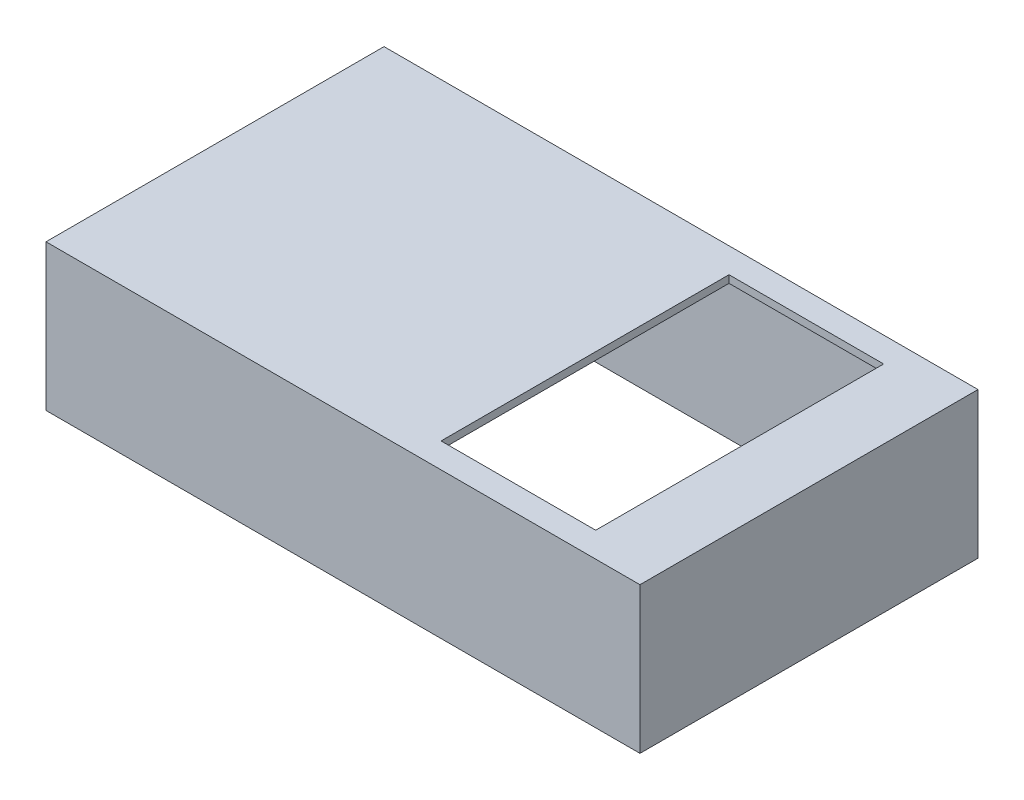
ISO-10303-21;
HEADER;
FILE_DESCRIPTION(('STEP AP214'),'2;1');
FILE_NAME('part.step','',(''),(''),'','','');
FILE_SCHEMA(('AUTOMOTIVE_DESIGN { 1 0 10303 214 1 1 1 1 }'));
ENDSEC;
DATA;
#1=APPLICATION_CONTEXT('core data for automotive mechanical design processes');
#2=APPLICATION_PROTOCOL_DEFINITION('international standard','automotive_design',2000,#1);
#3=PRODUCT_CONTEXT('',#1,'mechanical');
#4=PRODUCT('Part','Part','',(#3));
#5=PRODUCT_RELATED_PRODUCT_CATEGORY('part','',(#4));
#6=PRODUCT_DEFINITION_FORMATION('','',#4);
#7=PRODUCT_DEFINITION_CONTEXT('part definition',#1,'design');
#8=PRODUCT_DEFINITION('design','',#6,#7);
#9=PRODUCT_DEFINITION_SHAPE('','',#8);
#10=(LENGTH_UNIT() NAMED_UNIT(*) SI_UNIT(.MILLI.,.METRE.));
#11=(NAMED_UNIT(*) PLANE_ANGLE_UNIT() SI_UNIT($,.RADIAN.));
#12=(NAMED_UNIT(*) SI_UNIT($,.STERADIAN.) SOLID_ANGLE_UNIT());
#13=UNCERTAINTY_MEASURE_WITH_UNIT(LENGTH_MEASURE(1.E-05),#10,'distance_accuracy_value','');
#14=(GEOMETRIC_REPRESENTATION_CONTEXT(3) GLOBAL_UNCERTAINTY_ASSIGNED_CONTEXT((#13)) GLOBAL_UNIT_ASSIGNED_CONTEXT((#10,
#11,#12)) REPRESENTATION_CONTEXT('',''));
#15=CARTESIAN_POINT('',(0.,0.,0.));
#16=DIRECTION('',(0.,0.,1.));
#17=DIRECTION('',(1.,0.,0.));
#18=AXIS2_PLACEMENT_3D('',#15,#16,#17);
#19=CARTESIAN_POINT('',(34.7,0.,-29.35));
#20=DIRECTION('',(-1.,0.,0.));
#21=DIRECTION('',(0.,0.,1.));
#22=AXIS2_PLACEMENT_3D('',#19,#20,#21);
#23=PLANE('',#22);
#24=DIRECTION('',(0.,0.,1.));
#25=VECTOR('',#24,1.);
#26=CARTESIAN_POINT('',(34.7,13.,-29.35));
#27=LINE('',#26,#25);
#28=CARTESIAN_POINT('',(34.7,13.,-29.35));
#29=VERTEX_POINT('',#28);
#30=CARTESIAN_POINT('',(34.7,13.,-2.35));
#31=VERTEX_POINT('',#30);
#32=EDGE_CURVE('E62',#29,#31,#27,.T.);
#33=ORIENTED_EDGE('',*,*,#32,.F.);
#34=DIRECTION('',(0.,1.,0.));
#35=VECTOR('',#34,1.);
#36=CARTESIAN_POINT('',(34.7,0.,-29.35));
#37=LINE('',#36,#35);
#38=CARTESIAN_POINT('',(34.7,13.7,-29.35));
#39=VERTEX_POINT('',#38);
#40=EDGE_CURVE('E203',#29,#39,#37,.T.);
#41=ORIENTED_EDGE('',*,*,#40,.T.);
#42=DIRECTION('',(0.,0.,1.));
#43=VECTOR('',#42,1.);
#44=CARTESIAN_POINT('',(34.7,13.7,-29.35));
#45=LINE('',#44,#43);
#46=CARTESIAN_POINT('',(34.7,13.7,-2.35));
#47=VERTEX_POINT('',#46);
#48=EDGE_CURVE('E186',#39,#47,#45,.T.);
#49=ORIENTED_EDGE('',*,*,#48,.T.);
#50=DIRECTION('',(0.,1.,0.));
#51=VECTOR('',#50,1.);
#52=CARTESIAN_POINT('',(34.7,0.,-2.35));
#53=LINE('',#52,#51);
#54=EDGE_CURVE('E202',#31,#47,#53,.T.);
#55=ORIENTED_EDGE('',*,*,#54,.F.);
#56=EDGE_LOOP('',(#33,#41,#49,#55));
#57=FACE_BOUND('',#56,.T.);
#58=ADVANCED_FACE('F39',(#57),#23,.F.);
#59=CARTESIAN_POINT('',(34.7,0.,-29.35));
#60=DIRECTION('',(0.,0.,-1.));
#61=DIRECTION('',(-1.,0.,0.));
#62=AXIS2_PLACEMENT_3D('',#59,#60,#61);
#63=PLANE('',#62);
#64=DIRECTION('',(-1.,0.,0.));
#65=VECTOR('',#64,1.);
#66=CARTESIAN_POINT('',(34.7,13.,-29.35));
#67=LINE('',#66,#65);
#68=CARTESIAN_POINT('',(49.2,13.,-29.35));
#69=VERTEX_POINT('',#68);
#70=EDGE_CURVE('E181',#69,#29,#67,.T.);
#71=ORIENTED_EDGE('',*,*,#70,.F.);
#72=DIRECTION('',(0.,1.,0.));
#73=VECTOR('',#72,1.);
#74=CARTESIAN_POINT('',(49.2,0.,-29.35));
#75=LINE('',#74,#73);
#76=CARTESIAN_POINT('',(49.2,13.7,-29.35));
#77=VERTEX_POINT('',#76);
#78=EDGE_CURVE('E207',#69,#77,#75,.T.);
#79=ORIENTED_EDGE('',*,*,#78,.T.);
#80=DIRECTION('',(-1.,0.,0.));
#81=VECTOR('',#80,1.);
#82=CARTESIAN_POINT('',(34.7,13.7,-29.35));
#83=LINE('',#82,#81);
#84=EDGE_CURVE('E198',#77,#39,#83,.T.);
#85=ORIENTED_EDGE('',*,*,#84,.T.);
#86=ORIENTED_EDGE('',*,*,#40,.F.);
#87=EDGE_LOOP('',(#71,#79,#85,#86));
#88=FACE_BOUND('',#87,.T.);
#89=ADVANCED_FACE('F287',(#88),#63,.F.);
#90=CARTESIAN_POINT('',(49.2,0.,-29.35));
#91=DIRECTION('',(1.,0.,0.));
#92=DIRECTION('',(0.,0.,-1.));
#93=AXIS2_PLACEMENT_3D('',#90,#91,#92);
#94=PLANE('',#93);
#95=DIRECTION('',(0.,0.,-1.));
#96=VECTOR('',#95,1.);
#97=CARTESIAN_POINT('',(49.2,13.,-29.35));
#98=LINE('',#97,#96);
#99=CARTESIAN_POINT('',(49.2,13.,-2.35));
#100=VERTEX_POINT('',#99);
#101=EDGE_CURVE('E173',#100,#69,#98,.T.);
#102=ORIENTED_EDGE('',*,*,#101,.F.);
#103=DIRECTION('',(0.,1.,0.));
#104=VECTOR('',#103,1.);
#105=CARTESIAN_POINT('',(49.2,0.,-2.35));
#106=LINE('',#105,#104);
#107=CARTESIAN_POINT('',(49.2,13.7,-2.35));
#108=VERTEX_POINT('',#107);
#109=EDGE_CURVE('E210',#100,#108,#106,.T.);
#110=ORIENTED_EDGE('',*,*,#109,.T.);
#111=DIRECTION('',(0.,0.,-1.));
#112=VECTOR('',#111,1.);
#113=CARTESIAN_POINT('',(49.2,13.7,-29.35));
#114=LINE('',#113,#112);
#115=EDGE_CURVE('E194',#108,#77,#114,.T.);
#116=ORIENTED_EDGE('',*,*,#115,.T.);
#117=ORIENTED_EDGE('',*,*,#78,.F.);
#118=EDGE_LOOP('',(#102,#110,#116,#117));
#119=FACE_BOUND('',#118,.T.);
#120=ADVANCED_FACE('F292',(#119),#94,.F.);
#121=CARTESIAN_POINT('',(34.7,0.,-2.35));
#122=DIRECTION('',(0.,0.,1.));
#123=DIRECTION('',(1.,0.,0.));
#124=AXIS2_PLACEMENT_3D('',#121,#122,#123);
#125=PLANE('',#124);
#126=DIRECTION('',(1.,0.,0.));
#127=VECTOR('',#126,1.);
#128=CARTESIAN_POINT('',(34.7,13.,-2.35));
#129=LINE('',#128,#127);
#130=EDGE_CURVE('E11',#31,#100,#129,.T.);
#131=ORIENTED_EDGE('',*,*,#130,.F.);
#132=ORIENTED_EDGE('',*,*,#54,.T.);
#133=DIRECTION('',(1.,0.,0.));
#134=VECTOR('',#133,1.);
#135=CARTESIAN_POINT('',(34.7,13.7,-2.35));
#136=LINE('',#135,#134);
#137=EDGE_CURVE('E190',#47,#108,#136,.T.);
#138=ORIENTED_EDGE('',*,*,#137,.T.);
#139=ORIENTED_EDGE('',*,*,#109,.F.);
#140=EDGE_LOOP('',(#131,#132,#138,#139));
#141=FACE_BOUND('',#140,.T.);
#142=ADVANCED_FACE('F296',(#141),#125,.F.);
#143=CARTESIAN_POINT('',(0.,13.7,0.));
#144=DIRECTION('',(1.,0.,0.));
#145=DIRECTION('',(0.,0.,-1.));
#146=AXIS2_PLACEMENT_3D('',#143,#144,#145);
#147=PLANE('',#146);
#148=DIRECTION('',(0.,0.,1.));
#149=VECTOR('',#148,1.);
#150=CARTESIAN_POINT('',(0.,0.,0.));
#151=LINE('',#150,#149);
#152=CARTESIAN_POINT('',(0.,0.,-31.7));
#153=VERTEX_POINT('',#152);
#154=CARTESIAN_POINT('',(0.,0.,0.));
#155=VERTEX_POINT('',#154);
#156=EDGE_CURVE('E206',#153,#155,#151,.T.);
#157=ORIENTED_EDGE('',*,*,#156,.T.);
#158=DIRECTION('',(0.,-1.,0.));
#159=VECTOR('',#158,1.);
#160=CARTESIAN_POINT('',(0.,13.7,0.));
#161=LINE('',#160,#159);
#162=CARTESIAN_POINT('',(0.,13.7,0.));
#163=VERTEX_POINT('',#162);
#164=EDGE_CURVE('E48',#163,#155,#161,.T.);
#165=ORIENTED_EDGE('',*,*,#164,.F.);
#166=DIRECTION('',(0.,0.,1.));
#167=VECTOR('',#166,1.);
#168=CARTESIAN_POINT('',(0.,13.7,0.));
#169=LINE('',#168,#167);
#170=CARTESIAN_POINT('',(0.,13.7,-31.7));
#171=VERTEX_POINT('',#170);
#172=EDGE_CURVE('E215',#171,#163,#169,.T.);
#173=ORIENTED_EDGE('',*,*,#172,.F.);
#174=DIRECTION('',(0.,-1.,0.));
#175=VECTOR('',#174,1.);
#176=CARTESIAN_POINT('',(0.,13.7,-31.7));
#177=LINE('',#176,#175);
#178=EDGE_CURVE('E229',#171,#153,#177,.T.);
#179=ORIENTED_EDGE('',*,*,#178,.T.);
#180=EDGE_LOOP('',(#157,#165,#173,#179));
#181=FACE_BOUND('',#180,.T.);
#182=ADVANCED_FACE('F41',(#181),#147,.F.);
#183=CARTESIAN_POINT('',(0.,13.7,0.));
#184=DIRECTION('',(0.,0.,-1.));
#185=DIRECTION('',(-1.,0.,0.));
#186=AXIS2_PLACEMENT_3D('',#183,#184,#185);
#187=PLANE('',#186);
#188=DIRECTION('',(1.,0.,0.));
#189=VECTOR('',#188,1.);
#190=CARTESIAN_POINT('',(0.,0.,0.));
#191=LINE('',#190,#189);
#192=CARTESIAN_POINT('',(55.7,0.,0.));
#193=VERTEX_POINT('',#192);
#194=EDGE_CURVE('E233',#155,#193,#191,.T.);
#195=ORIENTED_EDGE('',*,*,#194,.T.);
#196=DIRECTION('',(0.,-1.,0.));
#197=VECTOR('',#196,1.);
#198=CARTESIAN_POINT('',(55.7,13.7,0.));
#199=LINE('',#198,#197);
#200=CARTESIAN_POINT('',(55.7,13.7,0.));
#201=VERTEX_POINT('',#200);
#202=EDGE_CURVE('E248',#201,#193,#199,.T.);
#203=ORIENTED_EDGE('',*,*,#202,.F.);
#204=DIRECTION('',(1.,0.,0.));
#205=VECTOR('',#204,1.);
#206=CARTESIAN_POINT('',(0.,13.7,0.));
#207=LINE('',#206,#205);
#208=EDGE_CURVE('E219',#163,#201,#207,.T.);
#209=ORIENTED_EDGE('',*,*,#208,.F.);
#210=ORIENTED_EDGE('',*,*,#164,.T.);
#211=EDGE_LOOP('',(#195,#203,#209,#210));
#212=FACE_BOUND('',#211,.T.);
#213=ADVANCED_FACE('F255',(#212),#187,.F.);
#214=CARTESIAN_POINT('',(55.7,13.7,0.));
#215=DIRECTION('',(-1.,0.,0.));
#216=DIRECTION('',(0.,0.,1.));
#217=AXIS2_PLACEMENT_3D('',#214,#215,#216);
#218=PLANE('',#217);
#219=DIRECTION('',(0.,0.,-1.));
#220=VECTOR('',#219,1.);
#221=CARTESIAN_POINT('',(55.7,0.,0.));
#222=LINE('',#221,#220);
#223=CARTESIAN_POINT('',(55.7,0.,-31.7));
#224=VERTEX_POINT('',#223);
#225=EDGE_CURVE('E236',#193,#224,#222,.T.);
#226=ORIENTED_EDGE('',*,*,#225,.T.);
#227=DIRECTION('',(0.,-1.,0.));
#228=VECTOR('',#227,1.);
#229=CARTESIAN_POINT('',(55.7,13.7,-31.7));
#230=LINE('',#229,#228);
#231=CARTESIAN_POINT('',(55.7,13.7,-31.7));
#232=VERTEX_POINT('',#231);
#233=EDGE_CURVE('E244',#232,#224,#230,.T.);
#234=ORIENTED_EDGE('',*,*,#233,.F.);
#235=DIRECTION('',(0.,0.,-1.));
#236=VECTOR('',#235,1.);
#237=CARTESIAN_POINT('',(55.7,13.7,0.));
#238=LINE('',#237,#236);
#239=EDGE_CURVE('E223',#201,#232,#238,.T.);
#240=ORIENTED_EDGE('',*,*,#239,.F.);
#241=ORIENTED_EDGE('',*,*,#202,.T.);
#242=EDGE_LOOP('',(#226,#234,#240,#241));
#243=FACE_BOUND('',#242,.T.);
#244=ADVANCED_FACE('F267',(#243),#218,.F.);
#245=CARTESIAN_POINT('',(0.,13.7,-31.7));
#246=DIRECTION('',(0.,0.,1.));
#247=DIRECTION('',(1.,0.,0.));
#248=AXIS2_PLACEMENT_3D('',#245,#246,#247);
#249=PLANE('',#248);
#250=DIRECTION('',(-1.,0.,0.));
#251=VECTOR('',#250,1.);
#252=CARTESIAN_POINT('',(0.,0.,-31.7));
#253=LINE('',#252,#251);
#254=EDGE_CURVE('E220',#224,#153,#253,.T.);
#255=ORIENTED_EDGE('',*,*,#254,.T.);
#256=ORIENTED_EDGE('',*,*,#178,.F.);
#257=DIRECTION('',(-1.,0.,0.));
#258=VECTOR('',#257,1.);
#259=CARTESIAN_POINT('',(0.,13.7,-31.7));
#260=LINE('',#259,#258);
#261=EDGE_CURVE('E226',#232,#171,#260,.T.);
#262=ORIENTED_EDGE('',*,*,#261,.F.);
#263=ORIENTED_EDGE('',*,*,#233,.T.);
#264=EDGE_LOOP('',(#255,#256,#262,#263));
#265=FACE_BOUND('',#264,.T.);
#266=ADVANCED_FACE('F271',(#265),#249,.F.);
#267=CARTESIAN_POINT('',(0.,13.7,0.));
#268=DIRECTION('',(0.,-1.,0.));
#269=DIRECTION('',(0.,0.,-1.));
#270=AXIS2_PLACEMENT_3D('',#267,#268,#269);
#271=PLANE('',#270);
#272=ORIENTED_EDGE('',*,*,#137,.F.);
#273=ORIENTED_EDGE('',*,*,#48,.F.);
#274=ORIENTED_EDGE('',*,*,#84,.F.);
#275=ORIENTED_EDGE('',*,*,#115,.F.);
#276=EDGE_LOOP('',(#272,#273,#274,#275));
#277=FACE_BOUND('',#276,.T.);
#278=ORIENTED_EDGE('',*,*,#172,.T.);
#279=ORIENTED_EDGE('',*,*,#208,.T.);
#280=ORIENTED_EDGE('',*,*,#239,.T.);
#281=ORIENTED_EDGE('',*,*,#261,.T.);
#282=EDGE_LOOP('',(#278,#279,#280,#281));
#283=FACE_BOUND('',#282,.T.);
#284=ADVANCED_FACE('F273',(#277,#283),#271,.F.);
#285=CARTESIAN_POINT('',(0.,0.,0.));
#286=DIRECTION('',(0.,-1.,0.));
#287=DIRECTION('',(0.,0.,-1.));
#288=AXIS2_PLACEMENT_3D('',#285,#286,#287);
#289=PLANE('',#288);
#290=DIRECTION('',(0.,0.,-1.));
#291=VECTOR('',#290,1.);
#292=CARTESIAN_POINT('',(2.,0.,-2.));
#293=LINE('',#292,#291);
#294=CARTESIAN_POINT('',(2.,0.,-2.));
#295=VERTEX_POINT('',#294);
#296=CARTESIAN_POINT('',(2.,0.,-29.7));
#297=VERTEX_POINT('',#296);
#298=EDGE_CURVE('E55',#295,#297,#293,.T.);
#299=ORIENTED_EDGE('',*,*,#298,.F.);
#300=DIRECTION('',(-1.,0.,0.));
#301=VECTOR('',#300,1.);
#302=CARTESIAN_POINT('',(2.,0.,-2.));
#303=LINE('',#302,#301);
#304=CARTESIAN_POINT('',(53.7,0.,-2.));
#305=VERTEX_POINT('',#304);
#306=EDGE_CURVE('E151',#305,#295,#303,.T.);
#307=ORIENTED_EDGE('',*,*,#306,.F.);
#308=DIRECTION('',(0.,0.,1.));
#309=VECTOR('',#308,1.);
#310=CARTESIAN_POINT('',(53.7,0.,-2.));
#311=LINE('',#310,#309);
#312=CARTESIAN_POINT('',(53.7,0.,-29.7));
#313=VERTEX_POINT('',#312);
#314=EDGE_CURVE('E155',#313,#305,#311,.T.);
#315=ORIENTED_EDGE('',*,*,#314,.F.);
#316=DIRECTION('',(1.,0.,0.));
#317=VECTOR('',#316,1.);
#318=CARTESIAN_POINT('',(2.,0.,-29.7));
#319=LINE('',#318,#317);
#320=EDGE_CURVE('E164',#297,#313,#319,.T.);
#321=ORIENTED_EDGE('',*,*,#320,.F.);
#322=EDGE_LOOP('',(#299,#307,#315,#321));
#323=FACE_BOUND('',#322,.T.);
#324=ORIENTED_EDGE('',*,*,#156,.F.);
#325=ORIENTED_EDGE('',*,*,#254,.F.);
#326=ORIENTED_EDGE('',*,*,#225,.F.);
#327=ORIENTED_EDGE('',*,*,#194,.F.);
#328=EDGE_LOOP('',(#324,#325,#326,#327));
#329=FACE_BOUND('',#328,.T.);
#330=ADVANCED_FACE('F263',(#323,#329),#289,.T.);
#331=CARTESIAN_POINT('',(0.,13.,0.));
#332=DIRECTION('',(0.,-1.,0.));
#333=DIRECTION('',(0.,0.,-1.));
#334=AXIS2_PLACEMENT_3D('',#331,#332,#333);
#335=PLANE('',#334);
#336=DIRECTION('',(0.,0.,-1.));
#337=VECTOR('',#336,1.);
#338=CARTESIAN_POINT('',(2.,13.,-2.));
#339=LINE('',#338,#337);
#340=CARTESIAN_POINT('',(2.,13.,-2.));
#341=VERTEX_POINT('',#340);
#342=CARTESIAN_POINT('',(2.,13.,-29.7));
#343=VERTEX_POINT('',#342);
#344=EDGE_CURVE('E130',#341,#343,#339,.T.);
#345=ORIENTED_EDGE('',*,*,#344,.T.);
#346=DIRECTION('',(1.,0.,0.));
#347=VECTOR('',#346,1.);
#348=CARTESIAN_POINT('',(2.,13.,-29.7));
#349=LINE('',#348,#347);
#350=CARTESIAN_POINT('',(53.7,13.,-29.7));
#351=VERTEX_POINT('',#350);
#352=EDGE_CURVE('E140',#343,#351,#349,.T.);
#353=ORIENTED_EDGE('',*,*,#352,.T.);
#354=DIRECTION('',(0.,0.,1.));
#355=VECTOR('',#354,1.);
#356=CARTESIAN_POINT('',(53.7,13.,-2.));
#357=LINE('',#356,#355);
#358=CARTESIAN_POINT('',(53.7,13.,-2.));
#359=VERTEX_POINT('',#358);
#360=EDGE_CURVE('E146',#351,#359,#357,.T.);
#361=ORIENTED_EDGE('',*,*,#360,.T.);
#362=DIRECTION('',(-1.,0.,0.));
#363=VECTOR('',#362,1.);
#364=CARTESIAN_POINT('',(2.,13.,-2.));
#365=LINE('',#364,#363);
#366=EDGE_CURVE('E137',#359,#341,#365,.T.);
#367=ORIENTED_EDGE('',*,*,#366,.T.);
#368=EDGE_LOOP('',(#345,#353,#361,#367));
#369=FACE_BOUND('',#368,.T.);
#370=ORIENTED_EDGE('',*,*,#32,.T.);
#371=ORIENTED_EDGE('',*,*,#130,.T.);
#372=ORIENTED_EDGE('',*,*,#101,.T.);
#373=ORIENTED_EDGE('',*,*,#70,.T.);
#374=EDGE_LOOP('',(#370,#371,#372,#373));
#375=FACE_BOUND('',#374,.T.);
#376=ADVANCED_FACE('F148',(#369,#375),#335,.T.);
#377=CARTESIAN_POINT('',(2.,13.,-2.));
#378=DIRECTION('',(-1.,0.,0.));
#379=DIRECTION('',(0.,0.,1.));
#380=AXIS2_PLACEMENT_3D('',#377,#378,#379);
#381=PLANE('',#380);
#382=ORIENTED_EDGE('',*,*,#298,.T.);
#383=DIRECTION('',(0.,-1.,0.));
#384=VECTOR('',#383,1.);
#385=CARTESIAN_POINT('',(2.,13.,-29.7));
#386=LINE('',#385,#384);
#387=EDGE_CURVE('E126',#343,#297,#386,.T.);
#388=ORIENTED_EDGE('',*,*,#387,.F.);
#389=ORIENTED_EDGE('',*,*,#344,.F.);
#390=DIRECTION('',(0.,-1.,0.));
#391=VECTOR('',#390,1.);
#392=CARTESIAN_POINT('',(2.,13.,-2.));
#393=LINE('',#392,#391);
#394=EDGE_CURVE('E170',#341,#295,#393,.T.);
#395=ORIENTED_EDGE('',*,*,#394,.T.);
#396=EDGE_LOOP('',(#382,#388,#389,#395));
#397=FACE_BOUND('',#396,.T.);
#398=ADVANCED_FACE('F128',(#397),#381,.F.);
#399=CARTESIAN_POINT('',(2.,13.,-2.));
#400=DIRECTION('',(0.,0.,1.));
#401=DIRECTION('',(1.,0.,0.));
#402=AXIS2_PLACEMENT_3D('',#399,#400,#401);
#403=PLANE('',#402);
#404=ORIENTED_EDGE('',*,*,#306,.T.);
#405=ORIENTED_EDGE('',*,*,#394,.F.);
#406=ORIENTED_EDGE('',*,*,#366,.F.);
#407=DIRECTION('',(0.,-1.,0.));
#408=VECTOR('',#407,1.);
#409=CARTESIAN_POINT('',(53.7,13.,-2.));
#410=LINE('',#409,#408);
#411=EDGE_CURVE('E174',#359,#305,#410,.T.);
#412=ORIENTED_EDGE('',*,*,#411,.T.);
#413=EDGE_LOOP('',(#404,#405,#406,#412));
#414=FACE_BOUND('',#413,.T.);
#415=ADVANCED_FACE('F305',(#414),#403,.F.);
#416=CARTESIAN_POINT('',(53.7,13.,-2.));
#417=DIRECTION('',(1.,0.,0.));
#418=DIRECTION('',(0.,0.,-1.));
#419=AXIS2_PLACEMENT_3D('',#416,#417,#418);
#420=PLANE('',#419);
#421=ORIENTED_EDGE('',*,*,#314,.T.);
#422=ORIENTED_EDGE('',*,*,#411,.F.);
#423=ORIENTED_EDGE('',*,*,#360,.F.);
#424=DIRECTION('',(0.,-1.,0.));
#425=VECTOR('',#424,1.);
#426=CARTESIAN_POINT('',(53.7,13.,-29.7));
#427=LINE('',#426,#425);
#428=EDGE_CURVE('E136',#351,#313,#427,.T.);
#429=ORIENTED_EDGE('',*,*,#428,.T.);
#430=EDGE_LOOP('',(#421,#422,#423,#429));
#431=FACE_BOUND('',#430,.T.);
#432=ADVANCED_FACE('F308',(#431),#420,.F.);
#433=CARTESIAN_POINT('',(2.,13.,-29.7));
#434=DIRECTION('',(0.,0.,-1.));
#435=DIRECTION('',(-1.,0.,0.));
#436=AXIS2_PLACEMENT_3D('',#433,#434,#435);
#437=PLANE('',#436);
#438=ORIENTED_EDGE('',*,*,#320,.T.);
#439=ORIENTED_EDGE('',*,*,#428,.F.);
#440=ORIENTED_EDGE('',*,*,#352,.F.);
#441=ORIENTED_EDGE('',*,*,#387,.T.);
#442=EDGE_LOOP('',(#438,#439,#440,#441));
#443=FACE_BOUND('',#442,.T.);
#444=ADVANCED_FACE('F141',(#443),#437,.F.);
#445=CLOSED_SHELL('',(#58,#89,#120,#142,#182,#213,#244,#266,#284,#330,#376,#398,#415,#432,#444));
#446=MANIFOLD_SOLID_BREP('B2',#445);
#447=ADVANCED_BREP_SHAPE_REPRESENTATION('',(#18,#446),#14);
#448=SHAPE_DEFINITION_REPRESENTATION(#9,#447);
ENDSEC;
END-ISO-10303-21;
